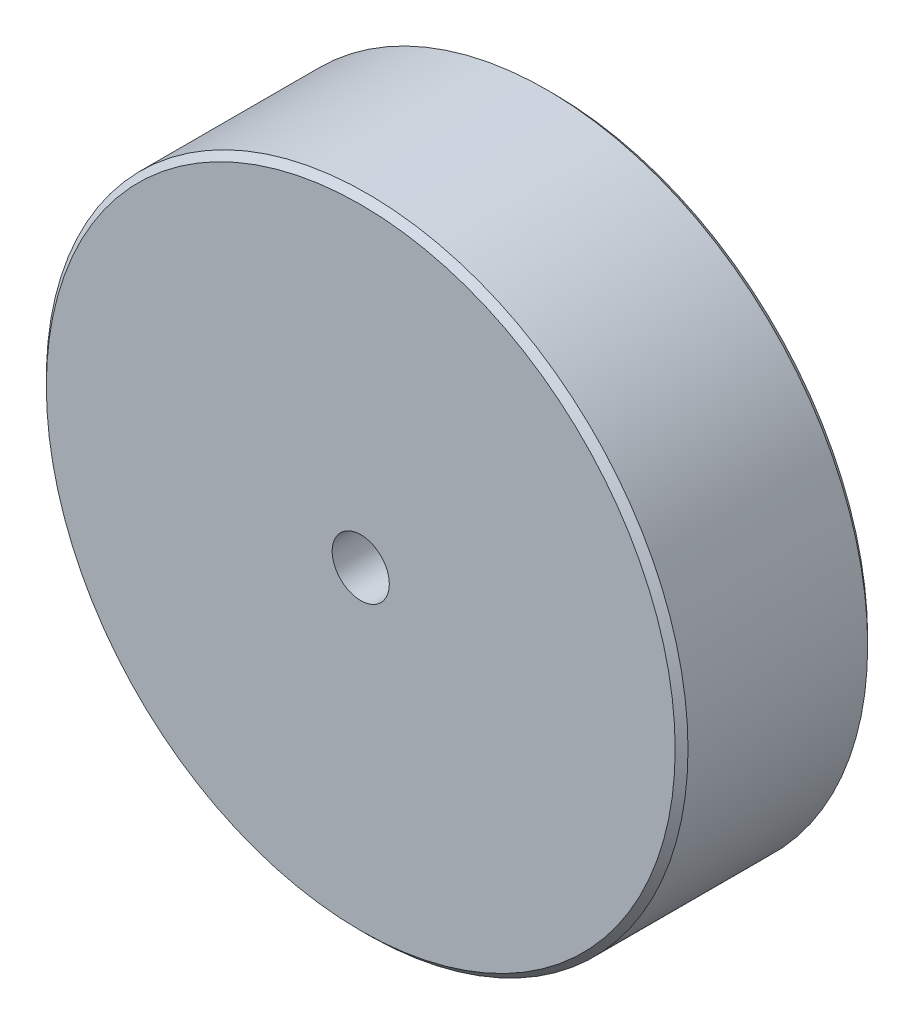
ISO-10303-21;
HEADER;
FILE_DESCRIPTION(('STEP AP214'),'2;1');
FILE_NAME('part.step','',(''),(''),'','','');
FILE_SCHEMA(('AUTOMOTIVE_DESIGN { 1 0 10303 214 1 1 1 1 }'));
ENDSEC;
DATA;
#1=APPLICATION_CONTEXT('core data for automotive mechanical design processes');
#2=APPLICATION_PROTOCOL_DEFINITION('international standard','automotive_design',2000,#1);
#3=PRODUCT_CONTEXT('',#1,'mechanical');
#4=PRODUCT('Part','Part','',(#3));
#5=PRODUCT_RELATED_PRODUCT_CATEGORY('part','',(#4));
#6=PRODUCT_DEFINITION_FORMATION('','',#4);
#7=PRODUCT_DEFINITION_CONTEXT('part definition',#1,'design');
#8=PRODUCT_DEFINITION('design','',#6,#7);
#9=PRODUCT_DEFINITION_SHAPE('','',#8);
#10=(LENGTH_UNIT() NAMED_UNIT(*) SI_UNIT(.MILLI.,.METRE.));
#11=(NAMED_UNIT(*) PLANE_ANGLE_UNIT() SI_UNIT($,.RADIAN.));
#12=(NAMED_UNIT(*) SI_UNIT($,.STERADIAN.) SOLID_ANGLE_UNIT());
#13=UNCERTAINTY_MEASURE_WITH_UNIT(LENGTH_MEASURE(1.E-05),#10,'distance_accuracy_value','');
#14=(GEOMETRIC_REPRESENTATION_CONTEXT(3) GLOBAL_UNCERTAINTY_ASSIGNED_CONTEXT((#13)) GLOBAL_UNIT_ASSIGNED_CONTEXT((#10,
#11,#12)) REPRESENTATION_CONTEXT('',''));
#15=CARTESIAN_POINT('',(0.,0.,0.));
#16=DIRECTION('',(0.,0.,1.));
#17=DIRECTION('',(1.,0.,0.));
#18=AXIS2_PLACEMENT_3D('',#15,#16,#17);
#19=CARTESIAN_POINT('',(0.,0.,7.62));
#20=DIRECTION('',(0.,0.,-1.));
#21=DIRECTION('',(-1.,0.,0.));
#22=AXIS2_PLACEMENT_3D('',#19,#20,#21);
#23=CYLINDRICAL_SURFACE('',#22,12.7);
#24=CARTESIAN_POINT('',(0.,0.,0.254000000000023));
#25=DIRECTION('',(0.,0.,1.));
#26=DIRECTION('',(1.,0.,0.));
#27=AXIS2_PLACEMENT_3D('',#24,#25,#26);
#28=CIRCLE('',#27,12.7);
#29=CARTESIAN_POINT('',(12.7,0.,0.254000000000023));
#30=VERTEX_POINT('',#29);
#31=EDGE_CURVE('E62',#30,#30,#28,.T.);
#32=ORIENTED_EDGE('',*,*,#31,.T.);
#33=EDGE_LOOP('',(#32));
#34=FACE_BOUND('',#33,.T.);
#35=CARTESIAN_POINT('',(0.,0.,7.36600000000001));
#36=DIRECTION('',(0.,0.,1.));
#37=DIRECTION('',(1.,0.,0.));
#38=AXIS2_PLACEMENT_3D('',#35,#36,#37);
#39=CIRCLE('',#38,12.7);
#40=CARTESIAN_POINT('',(12.7,0.,7.36600000000001));
#41=VERTEX_POINT('',#40);
#42=EDGE_CURVE('E58',#41,#41,#39,.F.);
#43=ORIENTED_EDGE('',*,*,#42,.T.);
#44=EDGE_LOOP('',(#43));
#45=FACE_BOUND('',#44,.T.);
#46=ADVANCED_FACE('F37',(#34,#45),#23,.T.);
#47=CARTESIAN_POINT('',(0.,0.,7.62));
#48=DIRECTION('',(0.,0.,1.));
#49=DIRECTION('',(1.,0.,0.));
#50=AXIS2_PLACEMENT_3D('',#47,#48,#49);
#51=PLANE('',#50);
#52=CARTESIAN_POINT('',(0.,0.,7.62));
#53=DIRECTION('',(0.,0.,1.));
#54=DIRECTION('',(1.,0.,0.));
#55=AXIS2_PLACEMENT_3D('',#52,#53,#54);
#56=CIRCLE('',#55,12.446);
#57=CARTESIAN_POINT('',(12.446,0.,7.62));
#58=VERTEX_POINT('',#57);
#59=EDGE_CURVE('E11',#58,#58,#56,.T.);
#60=ORIENTED_EDGE('',*,*,#59,.T.);
#61=EDGE_LOOP('',(#60));
#62=FACE_BOUND('',#61,.T.);
#63=CARTESIAN_POINT('',(0.,0.,7.62));
#64=DIRECTION('',(0.,0.,1.));
#65=DIRECTION('',(1.,0.,0.));
#66=AXIS2_PLACEMENT_3D('',#63,#64,#65);
#67=CIRCLE('',#66,1.13029999999999);
#68=CARTESIAN_POINT('',(1.13029999999999,0.,7.62));
#69=VERTEX_POINT('',#68);
#70=EDGE_CURVE('E59',#69,#69,#67,.T.);
#71=ORIENTED_EDGE('',*,*,#70,.F.);
#72=EDGE_LOOP('',(#71));
#73=FACE_BOUND('',#72,.T.);
#74=ADVANCED_FACE('F79',(#62,#73),#51,.T.);
#75=CARTESIAN_POINT('',(0.,0.,0.));
#76=DIRECTION('',(0.,0.,1.));
#77=DIRECTION('',(1.,0.,0.));
#78=AXIS2_PLACEMENT_3D('',#75,#76,#77);
#79=PLANE('',#78);
#80=CARTESIAN_POINT('',(0.,0.,0.));
#81=DIRECTION('',(0.,0.,1.));
#82=DIRECTION('',(1.,0.,0.));
#83=AXIS2_PLACEMENT_3D('',#80,#81,#82);
#84=CIRCLE('',#83,12.446);
#85=CARTESIAN_POINT('',(12.446,0.,0.));
#86=VERTEX_POINT('',#85);
#87=EDGE_CURVE('E45',#86,#86,#84,.F.);
#88=ORIENTED_EDGE('',*,*,#87,.T.);
#89=EDGE_LOOP('',(#88));
#90=FACE_BOUND('',#89,.T.);
#91=ADVANCED_FACE('F52',(#90),#79,.F.);
#92=CARTESIAN_POINT('',(0.,0.,1.94915275768685));
#93=DIRECTION('',(0.,0.,1.));
#94=DIRECTION('',(1.,0.,0.));
#95=AXIS2_PLACEMENT_3D('',#92,#93,#94);
#96=CONICAL_SURFACE('',#95,1.1303,1.02974425867665);
#97=CARTESIAN_POINT('',(0.,0.,1.27));
#98=VERTEX_POINT('',#97);
#99=VERTEX_LOOP('',#98);
#100=FACE_BOUND('',#99,.T.);
#101=CARTESIAN_POINT('',(0.,0.,1.94915275768685));
#102=DIRECTION('',(0.,0.,1.));
#103=DIRECTION('',(1.,0.,0.));
#104=AXIS2_PLACEMENT_3D('',#101,#102,#103);
#105=CIRCLE('',#104,1.1303);
#106=CARTESIAN_POINT('',(1.1303,0.,1.94915275768685));
#107=VERTEX_POINT('',#106);
#108=EDGE_CURVE('E56',#107,#107,#105,.T.);
#109=ORIENTED_EDGE('',*,*,#108,.T.);
#110=EDGE_LOOP('',(#109));
#111=FACE_BOUND('',#110,.T.);
#112=ADVANCED_FACE('F48',(#100,#111),#96,.F.);
#113=CARTESIAN_POINT('',(0.,0.,7.62));
#114=DIRECTION('',(0.,0.,1.));
#115=DIRECTION('',(1.,0.,0.));
#116=AXIS2_PLACEMENT_3D('',#113,#114,#115);
#117=CYLINDRICAL_SURFACE('',#116,1.13029999999999);
#118=ORIENTED_EDGE('',*,*,#108,.F.);
#119=EDGE_LOOP('',(#118));
#120=FACE_BOUND('',#119,.T.);
#121=ORIENTED_EDGE('',*,*,#70,.T.);
#122=EDGE_LOOP('',(#121));
#123=FACE_BOUND('',#122,.T.);
#124=ADVANCED_FACE('F51',(#120,#123),#117,.F.);
#125=CARTESIAN_POINT('',(0.,0.,0.254000000000023));
#126=DIRECTION('',(0.,0.,1.));
#127=DIRECTION('',(1.,0.,0.));
#128=AXIS2_PLACEMENT_3D('',#125,#126,#127);
#129=CONICAL_SURFACE('',#128,12.7,0.785398163397448);
#130=ORIENTED_EDGE('',*,*,#87,.F.);
#131=EDGE_LOOP('',(#130));
#132=FACE_BOUND('',#131,.T.);
#133=ORIENTED_EDGE('',*,*,#31,.F.);
#134=EDGE_LOOP('',(#133));
#135=FACE_BOUND('',#134,.T.);
#136=ADVANCED_FACE('F72',(#132,#135),#129,.T.);
#137=CARTESIAN_POINT('',(0.,0.,7.62));
#138=DIRECTION('',(0.,0.,-1.));
#139=DIRECTION('',(-1.,0.,0.));
#140=AXIS2_PLACEMENT_3D('',#137,#138,#139);
#141=CONICAL_SURFACE('',#140,12.446,0.785398163397445);
#142=ORIENTED_EDGE('',*,*,#42,.F.);
#143=EDGE_LOOP('',(#142));
#144=FACE_BOUND('',#143,.T.);
#145=ORIENTED_EDGE('',*,*,#59,.F.);
#146=EDGE_LOOP('',(#145));
#147=FACE_BOUND('',#146,.T.);
#148=ADVANCED_FACE('F40',(#144,#147),#141,.T.);
#149=CLOSED_SHELL('',(#46,#74,#91,#112,#124,#136,#148));
#150=MANIFOLD_SOLID_BREP('B2',#149);
#151=ADVANCED_BREP_SHAPE_REPRESENTATION('',(#18,#150),#14);
#152=SHAPE_DEFINITION_REPRESENTATION(#9,#151);
ENDSEC;
END-ISO-10303-21;
